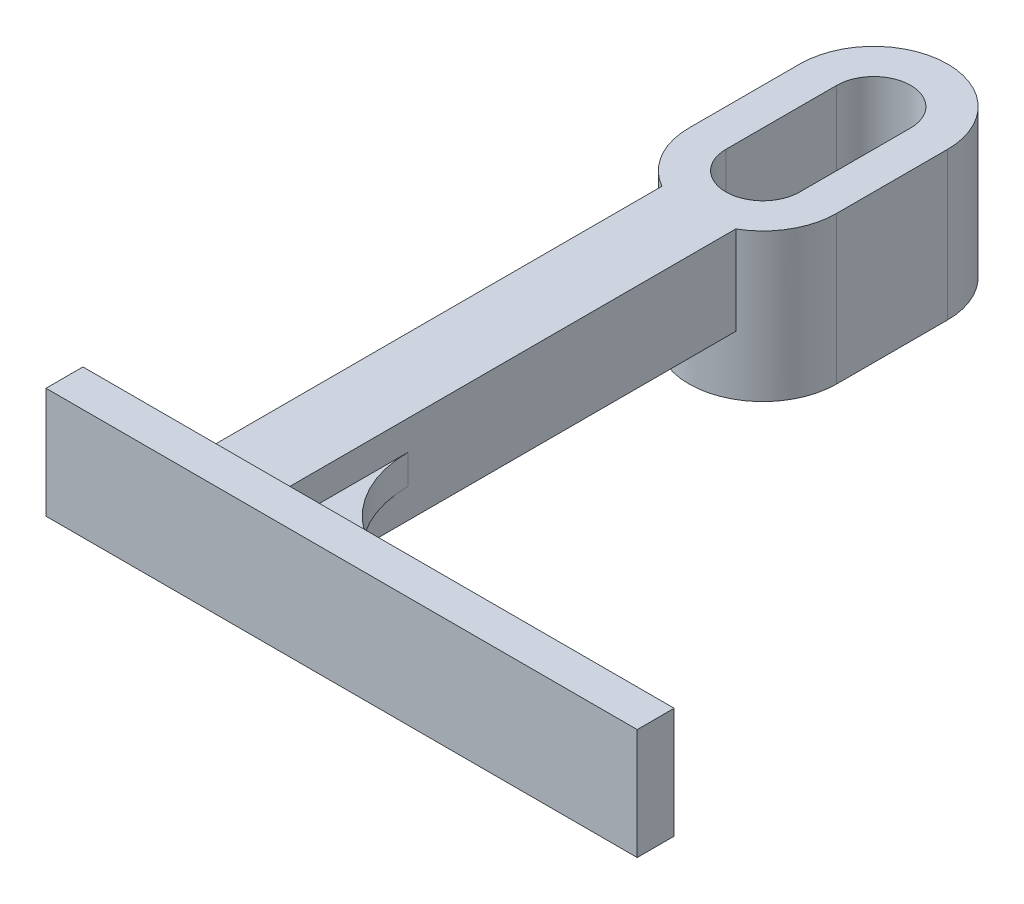
ISO-10303-21;
HEADER;
FILE_DESCRIPTION(('STEP AP214'),'2;1');
FILE_NAME('part.step','',(''),(''),'','','');
FILE_SCHEMA(('AUTOMOTIVE_DESIGN { 1 0 10303 214 1 1 1 1 }'));
ENDSEC;
DATA;
#1=APPLICATION_CONTEXT('core data for automotive mechanical design processes');
#2=APPLICATION_PROTOCOL_DEFINITION('international standard','automotive_design',2000,#1);
#3=PRODUCT_CONTEXT('',#1,'mechanical');
#4=PRODUCT('Part','Part','',(#3));
#5=PRODUCT_RELATED_PRODUCT_CATEGORY('part','',(#4));
#6=PRODUCT_DEFINITION_FORMATION('','',#4);
#7=PRODUCT_DEFINITION_CONTEXT('part definition',#1,'design');
#8=PRODUCT_DEFINITION('design','',#6,#7);
#9=PRODUCT_DEFINITION_SHAPE('','',#8);
#10=(LENGTH_UNIT() NAMED_UNIT(*) SI_UNIT(.MILLI.,.METRE.));
#11=(NAMED_UNIT(*) PLANE_ANGLE_UNIT() SI_UNIT($,.RADIAN.));
#12=(NAMED_UNIT(*) SI_UNIT($,.STERADIAN.) SOLID_ANGLE_UNIT());
#13=UNCERTAINTY_MEASURE_WITH_UNIT(LENGTH_MEASURE(1.E-05),#10,'distance_accuracy_value','');
#14=(GEOMETRIC_REPRESENTATION_CONTEXT(3) GLOBAL_UNCERTAINTY_ASSIGNED_CONTEXT((#13)) GLOBAL_UNIT_ASSIGNED_CONTEXT((#10,
#11,#12)) REPRESENTATION_CONTEXT('',''));
#15=CARTESIAN_POINT('',(0.,0.,0.));
#16=DIRECTION('',(0.,0.,1.));
#17=DIRECTION('',(1.,0.,0.));
#18=AXIS2_PLACEMENT_3D('',#15,#16,#17);
#19=CARTESIAN_POINT('',(-20.,12.,87.));
#20=DIRECTION('',(0.,0.,-1.));
#21=DIRECTION('',(-1.,0.,0.));
#22=AXIS2_PLACEMENT_3D('',#19,#20,#21);
#23=PLANE('',#22);
#24=DIRECTION('',(0.,-1.,0.));
#25=VECTOR('',#24,1.);
#26=CARTESIAN_POINT('',(-20.,12.,87.));
#27=LINE('',#26,#25);
#28=CARTESIAN_POINT('',(-20.,4.,87.));
#29=VERTEX_POINT('',#28);
#30=CARTESIAN_POINT('',(-20.,0.,87.));
#31=VERTEX_POINT('',#30);
#32=EDGE_CURVE('E299',#29,#31,#27,.T.);
#33=ORIENTED_EDGE('',*,*,#32,.F.);
#34=DIRECTION('',(1.,0.,0.));
#35=VECTOR('',#34,1.);
#36=CARTESIAN_POINT('',(-4.99999999999999,4.,87.));
#37=LINE('',#36,#35);
#38=CARTESIAN_POINT('',(-4.99999999999999,4.,87.));
#39=VERTEX_POINT('',#38);
#40=EDGE_CURVE('E433',#29,#39,#37,.T.);
#41=ORIENTED_EDGE('',*,*,#40,.T.);
#42=DIRECTION('',(0.,-1.,0.));
#43=VECTOR('',#42,1.);
#44=CARTESIAN_POINT('',(-4.99999999999999,12.,87.));
#45=LINE('',#44,#43);
#46=CARTESIAN_POINT('',(-4.99999999999999,0.,87.));
#47=VERTEX_POINT('',#46);
#48=EDGE_CURVE('E253',#39,#47,#45,.T.);
#49=ORIENTED_EDGE('',*,*,#48,.T.);
#50=DIRECTION('',(1.,0.,0.));
#51=VECTOR('',#50,1.);
#52=CARTESIAN_POINT('',(-20.,0.,87.));
#53=LINE('',#52,#51);
#54=EDGE_CURVE('E291',#31,#47,#53,.T.);
#55=ORIENTED_EDGE('',*,*,#54,.F.);
#56=EDGE_LOOP('',(#33,#41,#49,#55));
#57=FACE_BOUND('',#56,.T.);
#58=ADVANCED_FACE('F71',(#57),#23,.T.);
#59=CARTESIAN_POINT('',(0.,0.,0.));
#60=DIRECTION('',(0.,1.,0.));
#61=DIRECTION('',(0.,0.,1.));
#62=AXIS2_PLACEMENT_3D('',#59,#60,#61);
#63=PLANE('',#62);
#64=CARTESIAN_POINT('',(0.,0.,15.));
#65=DIRECTION('',(0.,-1.,0.));
#66=DIRECTION('',(0.,0.,-1.));
#67=AXIS2_PLACEMENT_3D('',#64,#65,#66);
#68=CIRCLE('',#67,9.99999999999999);
#69=CARTESIAN_POINT('',(5.,0.,23.6602540378444));
#70=VERTEX_POINT('',#69);
#71=CARTESIAN_POINT('',(-5.,0.,23.6602540378444));
#72=VERTEX_POINT('',#71);
#73=EDGE_CURVE('E80',#70,#72,#68,.T.);
#74=ORIENTED_EDGE('',*,*,#73,.F.);
#75=DIRECTION('',(0.,0.,1.));
#76=VECTOR('',#75,1.);
#77=CARTESIAN_POINT('',(5.,0.,0.));
#78=LINE('',#77,#76);
#79=CARTESIAN_POINT('',(5.00000000000001,0.,87.));
#80=VERTEX_POINT('',#79);
#81=EDGE_CURVE('E302',#70,#80,#78,.T.);
#82=ORIENTED_EDGE('',*,*,#81,.T.);
#83=CARTESIAN_POINT('',(60.,0.,87.));
#84=VERTEX_POINT('',#83);
#85=EDGE_CURVE('E289',#80,#84,#53,.T.);
#86=ORIENTED_EDGE('',*,*,#85,.T.);
#87=DIRECTION('',(0.,0.,-1.));
#88=VECTOR('',#87,1.);
#89=CARTESIAN_POINT('',(60.,0.,92.));
#90=LINE('',#89,#88);
#91=CARTESIAN_POINT('',(60.,0.,92.));
#92=VERTEX_POINT('',#91);
#93=EDGE_CURVE('E294',#92,#84,#90,.T.);
#94=ORIENTED_EDGE('',*,*,#93,.F.);
#95=DIRECTION('',(1.,0.,0.));
#96=VECTOR('',#95,1.);
#97=CARTESIAN_POINT('',(-20.,0.,92.));
#98=LINE('',#97,#96);
#99=CARTESIAN_POINT('',(-20.,0.,92.));
#100=VERTEX_POINT('',#99);
#101=EDGE_CURVE('E297',#100,#92,#98,.T.);
#102=ORIENTED_EDGE('',*,*,#101,.F.);
#103=DIRECTION('',(0.,0.,-1.));
#104=VECTOR('',#103,1.);
#105=CARTESIAN_POINT('',(-20.,0.,92.));
#106=LINE('',#105,#104);
#107=EDGE_CURVE('E286',#100,#31,#106,.T.);
#108=ORIENTED_EDGE('',*,*,#107,.T.);
#109=ORIENTED_EDGE('',*,*,#54,.T.);
#110=DIRECTION('',(0.,0.,1.));
#111=VECTOR('',#110,1.);
#112=CARTESIAN_POINT('',(-5.,0.,0.));
#113=LINE('',#112,#111);
#114=EDGE_CURVE('E260',#72,#47,#113,.T.);
#115=ORIENTED_EDGE('',*,*,#114,.F.);
#116=EDGE_LOOP('',(#74,#82,#86,#94,#102,#108,#109,#115));
#117=FACE_BOUND('',#116,.T.);
#118=ADVANCED_FACE('F324',(#117),#63,.F.);
#119=CARTESIAN_POINT('',(5.,12.,0.));
#120=DIRECTION('',(1.,0.,0.));
#121=DIRECTION('',(0.,0.,-1.));
#122=AXIS2_PLACEMENT_3D('',#119,#120,#121);
#123=PLANE('',#122);
#124=DIRECTION('',(0.,0.,1.));
#125=VECTOR('',#124,1.);
#126=CARTESIAN_POINT('',(5.00000000000001,8.,87.));
#127=LINE('',#126,#125);
#128=CARTESIAN_POINT('',(4.99999999999999,8.,68.));
#129=VERTEX_POINT('',#128);
#130=CARTESIAN_POINT('',(5.00000000000001,8.,87.));
#131=VERTEX_POINT('',#130);
#132=EDGE_CURVE('E227',#129,#131,#127,.T.);
#133=ORIENTED_EDGE('',*,*,#132,.F.);
#134=DIRECTION('',(0.,-1.,0.));
#135=VECTOR('',#134,1.);
#136=CARTESIAN_POINT('',(4.99999999999999,8.,68.));
#137=LINE('',#136,#135);
#138=CARTESIAN_POINT('',(4.99999999999999,4.,68.));
#139=VERTEX_POINT('',#138);
#140=EDGE_CURVE('E417',#129,#139,#137,.T.);
#141=ORIENTED_EDGE('',*,*,#140,.T.);
#142=DIRECTION('',(0.,0.,1.));
#143=VECTOR('',#142,1.);
#144=CARTESIAN_POINT('',(5.00000000000001,4.,87.));
#145=LINE('',#144,#143);
#146=CARTESIAN_POINT('',(5.00000000000001,4.,87.));
#147=VERTEX_POINT('',#146);
#148=EDGE_CURVE('E409',#139,#147,#145,.T.);
#149=ORIENTED_EDGE('',*,*,#148,.T.);
#150=DIRECTION('',(0.,-1.,0.));
#151=VECTOR('',#150,1.);
#152=CARTESIAN_POINT('',(5.00000000000001,12.,87.));
#153=LINE('',#152,#151);
#154=EDGE_CURVE('E254',#147,#80,#153,.T.);
#155=ORIENTED_EDGE('',*,*,#154,.T.);
#156=ORIENTED_EDGE('',*,*,#81,.F.);
#157=DIRECTION('',(0.,-1.,0.));
#158=VECTOR('',#157,1.);
#159=CARTESIAN_POINT('',(5.,12.,23.6602540378444));
#160=LINE('',#159,#158);
#161=CARTESIAN_POINT('',(5.,12.,23.6602540378444));
#162=VERTEX_POINT('',#161);
#163=EDGE_CURVE('E275',#162,#70,#160,.T.);
#164=ORIENTED_EDGE('',*,*,#163,.F.);
#165=DIRECTION('',(0.,0.,1.));
#166=VECTOR('',#165,1.);
#167=CARTESIAN_POINT('',(5.,12.,0.));
#168=LINE('',#167,#166);
#169=CARTESIAN_POINT('',(5.,12.,87.));
#170=VERTEX_POINT('',#169);
#171=EDGE_CURVE('E252',#162,#170,#168,.T.);
#172=ORIENTED_EDGE('',*,*,#171,.T.);
#173=EDGE_CURVE('E244',#170,#131,#153,.T.);
#174=ORIENTED_EDGE('',*,*,#173,.T.);
#175=EDGE_LOOP('',(#133,#141,#149,#155,#156,#164,#172,#174));
#176=FACE_BOUND('',#175,.T.);
#177=ADVANCED_FACE('F250',(#176),#123,.T.);
#178=CARTESIAN_POINT('',(10.,12.,0.));
#179=DIRECTION('',(1.,0.,0.));
#180=DIRECTION('',(0.,0.,-1.));
#181=AXIS2_PLACEMENT_3D('',#178,#179,#180);
#182=PLANE('',#181);
#183=DIRECTION('',(0.,-1.,0.));
#184=VECTOR('',#183,1.);
#185=CARTESIAN_POINT('',(10.,12.,15.));
#186=LINE('',#185,#184);
#187=CARTESIAN_POINT('',(10.,12.,15.));
#188=VERTEX_POINT('',#187);
#189=CARTESIAN_POINT('',(9.99999999999999,-8.,15.));
#190=VERTEX_POINT('',#189);
#191=EDGE_CURVE('E273',#188,#190,#186,.T.);
#192=ORIENTED_EDGE('',*,*,#191,.T.);
#193=DIRECTION('',(0.,0.,1.));
#194=VECTOR('',#193,1.);
#195=CARTESIAN_POINT('',(9.99999999999999,-8.,15.));
#196=LINE('',#195,#194);
#197=CARTESIAN_POINT('',(10.,-8.,0.));
#198=VERTEX_POINT('',#197);
#199=EDGE_CURVE('E290',#198,#190,#196,.T.);
#200=ORIENTED_EDGE('',*,*,#199,.F.);
#201=DIRECTION('',(0.,-1.,0.));
#202=VECTOR('',#201,1.);
#203=CARTESIAN_POINT('',(10.,12.,0.));
#204=LINE('',#203,#202);
#205=CARTESIAN_POINT('',(10.,12.,0.));
#206=VERTEX_POINT('',#205);
#207=EDGE_CURVE('E271',#206,#198,#204,.T.);
#208=ORIENTED_EDGE('',*,*,#207,.F.);
#209=DIRECTION('',(0.,0.,1.));
#210=VECTOR('',#209,1.);
#211=CARTESIAN_POINT('',(10.,12.,0.));
#212=LINE('',#211,#210);
#213=EDGE_CURVE('E383',#206,#188,#212,.T.);
#214=ORIENTED_EDGE('',*,*,#213,.T.);
#215=EDGE_LOOP('',(#192,#200,#208,#214));
#216=FACE_BOUND('',#215,.T.);
#217=ADVANCED_FACE('F504',(#216),#182,.T.);
#218=CARTESIAN_POINT('',(0.,12.,0.));
#219=DIRECTION('',(0.,-1.,0.));
#220=DIRECTION('',(0.,0.,-1.));
#221=AXIS2_PLACEMENT_3D('',#218,#219,#220);
#222=CYLINDRICAL_SURFACE('',#221,10.);
#223=ORIENTED_EDGE('',*,*,#207,.T.);
#224=CARTESIAN_POINT('',(0.,-8.,0.));
#225=DIRECTION('',(0.,-1.,0.));
#226=DIRECTION('',(0.,0.,-1.));
#227=AXIS2_PLACEMENT_3D('',#224,#225,#226);
#228=CIRCLE('',#227,9.99999999999999);
#229=CARTESIAN_POINT('',(-9.99999999999999,-8.,0.));
#230=VERTEX_POINT('',#229);
#231=EDGE_CURVE('E363',#230,#198,#228,.T.);
#232=ORIENTED_EDGE('',*,*,#231,.F.);
#233=DIRECTION('',(0.,-1.,0.));
#234=VECTOR('',#233,1.);
#235=CARTESIAN_POINT('',(-10.,12.,0.));
#236=LINE('',#235,#234);
#237=CARTESIAN_POINT('',(-10.,12.,0.));
#238=VERTEX_POINT('',#237);
#239=EDGE_CURVE('E269',#238,#230,#236,.T.);
#240=ORIENTED_EDGE('',*,*,#239,.F.);
#241=CARTESIAN_POINT('',(0.,12.,0.));
#242=DIRECTION('',(0.,1.,0.));
#243=DIRECTION('',(0.,0.,1.));
#244=AXIS2_PLACEMENT_3D('',#241,#242,#243);
#245=CIRCLE('',#244,10.);
#246=EDGE_CURVE('E386',#206,#238,#245,.T.);
#247=ORIENTED_EDGE('',*,*,#246,.F.);
#248=EDGE_LOOP('',(#223,#232,#240,#247));
#249=FACE_BOUND('',#248,.T.);
#250=ADVANCED_FACE('F507',(#249),#222,.T.);
#251=CARTESIAN_POINT('',(-10.,12.,0.));
#252=DIRECTION('',(1.,0.,0.));
#253=DIRECTION('',(0.,0.,-1.));
#254=AXIS2_PLACEMENT_3D('',#251,#252,#253);
#255=PLANE('',#254);
#256=ORIENTED_EDGE('',*,*,#239,.T.);
#257=DIRECTION('',(0.,0.,-1.));
#258=VECTOR('',#257,1.);
#259=CARTESIAN_POINT('',(-9.99999999999999,-8.,15.));
#260=LINE('',#259,#258);
#261=CARTESIAN_POINT('',(-9.99999999999999,-8.,15.));
#262=VERTEX_POINT('',#261);
#263=EDGE_CURVE('E360',#262,#230,#260,.T.);
#264=ORIENTED_EDGE('',*,*,#263,.F.);
#265=DIRECTION('',(0.,-1.,0.));
#266=VECTOR('',#265,1.);
#267=CARTESIAN_POINT('',(-10.,12.,15.));
#268=LINE('',#267,#266);
#269=CARTESIAN_POINT('',(-10.,12.,15.));
#270=VERTEX_POINT('',#269);
#271=EDGE_CURVE('E267',#270,#262,#268,.T.);
#272=ORIENTED_EDGE('',*,*,#271,.F.);
#273=DIRECTION('',(0.,0.,1.));
#274=VECTOR('',#273,1.);
#275=CARTESIAN_POINT('',(-10.,12.,0.));
#276=LINE('',#275,#274);
#277=EDGE_CURVE('E389',#238,#270,#276,.T.);
#278=ORIENTED_EDGE('',*,*,#277,.F.);
#279=EDGE_LOOP('',(#256,#264,#272,#278));
#280=FACE_BOUND('',#279,.T.);
#281=ADVANCED_FACE('F511',(#280),#255,.F.);
#282=CARTESIAN_POINT('',(0.,12.,15.));
#283=DIRECTION('',(0.,-1.,0.));
#284=DIRECTION('',(0.,0.,-1.));
#285=AXIS2_PLACEMENT_3D('',#282,#283,#284);
#286=CYLINDRICAL_SURFACE('',#285,10.);
#287=ORIENTED_EDGE('',*,*,#271,.T.);
#288=CARTESIAN_POINT('',(0.,-8.,15.));
#289=DIRECTION('',(0.,-1.,0.));
#290=DIRECTION('',(0.,0.,-1.));
#291=AXIS2_PLACEMENT_3D('',#288,#289,#290);
#292=CIRCLE('',#291,9.99999999999999);
#293=EDGE_CURVE('E357',#190,#262,#292,.T.);
#294=ORIENTED_EDGE('',*,*,#293,.F.);
#295=ORIENTED_EDGE('',*,*,#191,.F.);
#296=CARTESIAN_POINT('',(0.,12.,15.));
#297=DIRECTION('',(0.,1.,0.));
#298=DIRECTION('',(0.,0.,1.));
#299=AXIS2_PLACEMENT_3D('',#296,#297,#298);
#300=CIRCLE('',#299,10.);
#301=EDGE_CURVE('E381',#162,#188,#300,.T.);
#302=ORIENTED_EDGE('',*,*,#301,.F.);
#303=ORIENTED_EDGE('',*,*,#163,.T.);
#304=ORIENTED_EDGE('',*,*,#73,.T.);
#305=DIRECTION('',(0.,-1.,0.));
#306=VECTOR('',#305,1.);
#307=CARTESIAN_POINT('',(-5.,12.,23.6602540378444));
#308=LINE('',#307,#306);
#309=CARTESIAN_POINT('',(-5.,12.,23.6602540378444));
#310=VERTEX_POINT('',#309);
#311=EDGE_CURVE('E264',#310,#72,#308,.T.);
#312=ORIENTED_EDGE('',*,*,#311,.F.);
#313=CARTESIAN_POINT('',(0.,12.,15.));
#314=DIRECTION('',(0.,1.,0.));
#315=DIRECTION('',(0.,0.,1.));
#316=AXIS2_PLACEMENT_3D('',#313,#314,#315);
#317=CIRCLE('',#316,10.);
#318=EDGE_CURVE('E392',#270,#310,#317,.T.);
#319=ORIENTED_EDGE('',*,*,#318,.F.);
#320=EDGE_LOOP('',(#287,#294,#295,#302,#303,#304,#312,#319));
#321=FACE_BOUND('',#320,.T.);
#322=ADVANCED_FACE('F404',(#321),#286,.T.);
#323=CARTESIAN_POINT('',(-5.,12.,0.));
#324=DIRECTION('',(1.,0.,0.));
#325=DIRECTION('',(0.,0.,-1.));
#326=AXIS2_PLACEMENT_3D('',#323,#324,#325);
#327=PLANE('',#326);
#328=DIRECTION('',(0.,-1.,0.));
#329=VECTOR('',#328,1.);
#330=CARTESIAN_POINT('',(-5.,8.,72.));
#331=LINE('',#330,#329);
#332=CARTESIAN_POINT('',(-5.,8.,72.));
#333=VERTEX_POINT('',#332);
#334=CARTESIAN_POINT('',(-5.,4.,72.));
#335=VERTEX_POINT('',#334);
#336=EDGE_CURVE('E430',#333,#335,#331,.T.);
#337=ORIENTED_EDGE('',*,*,#336,.F.);
#338=DIRECTION('',(0.,0.,-1.));
#339=VECTOR('',#338,1.);
#340=CARTESIAN_POINT('',(-5.,8.,72.));
#341=LINE('',#340,#339);
#342=CARTESIAN_POINT('',(-4.99999999999999,8.,87.));
#343=VERTEX_POINT('',#342);
#344=EDGE_CURVE('E428',#343,#333,#341,.T.);
#345=ORIENTED_EDGE('',*,*,#344,.F.);
#346=CARTESIAN_POINT('',(-4.99999999999999,12.,87.));
#347=VERTEX_POINT('',#346);
#348=EDGE_CURVE('E256',#347,#343,#45,.T.);
#349=ORIENTED_EDGE('',*,*,#348,.F.);
#350=DIRECTION('',(0.,0.,1.));
#351=VECTOR('',#350,1.);
#352=CARTESIAN_POINT('',(-5.,12.,0.));
#353=LINE('',#352,#351);
#354=EDGE_CURVE('E281',#310,#347,#353,.T.);
#355=ORIENTED_EDGE('',*,*,#354,.F.);
#356=ORIENTED_EDGE('',*,*,#311,.T.);
#357=ORIENTED_EDGE('',*,*,#114,.T.);
#358=ORIENTED_EDGE('',*,*,#48,.F.);
#359=DIRECTION('',(0.,0.,-1.));
#360=VECTOR('',#359,1.);
#361=CARTESIAN_POINT('',(-5.,4.,72.));
#362=LINE('',#361,#360);
#363=EDGE_CURVE('E96',#39,#335,#362,.T.);
#364=ORIENTED_EDGE('',*,*,#363,.T.);
#365=EDGE_LOOP('',(#337,#345,#349,#355,#356,#357,#358,#364));
#366=FACE_BOUND('',#365,.T.);
#367=ADVANCED_FACE('F400',(#366),#327,.F.);
#368=CARTESIAN_POINT('',(0.,12.,15.));
#369=DIRECTION('',(0.,-1.,0.));
#370=DIRECTION('',(0.,0.,-1.));
#371=AXIS2_PLACEMENT_3D('',#368,#369,#370);
#372=CYLINDRICAL_SURFACE('',#371,5.);
#373=DIRECTION('',(0.,-1.,0.));
#374=VECTOR('',#373,1.);
#375=CARTESIAN_POINT('',(5.,12.,15.));
#376=LINE('',#375,#374);
#377=CARTESIAN_POINT('',(5.,12.,15.));
#378=VERTEX_POINT('',#377);
#379=CARTESIAN_POINT('',(5.,-8.,15.));
#380=VERTEX_POINT('',#379);
#381=EDGE_CURVE('E278',#378,#380,#376,.T.);
#382=ORIENTED_EDGE('',*,*,#381,.T.);
#383=CARTESIAN_POINT('',(0.,-8.,15.));
#384=DIRECTION('',(0.,-1.,0.));
#385=DIRECTION('',(0.,0.,-1.));
#386=AXIS2_PLACEMENT_3D('',#383,#384,#385);
#387=CIRCLE('',#386,5.);
#388=CARTESIAN_POINT('',(-5.,-8.,15.));
#389=VERTEX_POINT('',#388);
#390=EDGE_CURVE('E351',#380,#389,#387,.T.);
#391=ORIENTED_EDGE('',*,*,#390,.T.);
#392=DIRECTION('',(0.,-1.,0.));
#393=VECTOR('',#392,1.);
#394=CARTESIAN_POINT('',(-5.,12.,15.));
#395=LINE('',#394,#393);
#396=CARTESIAN_POINT('',(-5.,12.,15.));
#397=VERTEX_POINT('',#396);
#398=EDGE_CURVE('E258',#397,#389,#395,.T.);
#399=ORIENTED_EDGE('',*,*,#398,.F.);
#400=CARTESIAN_POINT('',(0.,12.,15.));
#401=DIRECTION('',(0.,1.,0.));
#402=DIRECTION('',(0.,0.,1.));
#403=AXIS2_PLACEMENT_3D('',#400,#401,#402);
#404=CIRCLE('',#403,5.);
#405=EDGE_CURVE('E369',#397,#378,#404,.T.);
#406=ORIENTED_EDGE('',*,*,#405,.T.);
#407=EDGE_LOOP('',(#382,#391,#399,#406));
#408=FACE_BOUND('',#407,.T.);
#409=ADVANCED_FACE('F487',(#408),#372,.F.);
#410=CARTESIAN_POINT('',(-5.,12.,0.));
#411=DIRECTION('',(1.,0.,0.));
#412=DIRECTION('',(0.,0.,-1.));
#413=AXIS2_PLACEMENT_3D('',#410,#411,#412);
#414=PLANE('',#413);
#415=ORIENTED_EDGE('',*,*,#398,.T.);
#416=DIRECTION('',(0.,0.,-1.));
#417=VECTOR('',#416,1.);
#418=CARTESIAN_POINT('',(-5.,-8.,0.));
#419=LINE('',#418,#417);
#420=CARTESIAN_POINT('',(-5.,-8.,0.));
#421=VERTEX_POINT('',#420);
#422=EDGE_CURVE('E354',#389,#421,#419,.T.);
#423=ORIENTED_EDGE('',*,*,#422,.T.);
#424=DIRECTION('',(0.,-1.,0.));
#425=VECTOR('',#424,1.);
#426=CARTESIAN_POINT('',(-5.,12.,0.));
#427=LINE('',#426,#425);
#428=CARTESIAN_POINT('',(-5.,12.,0.));
#429=VERTEX_POINT('',#428);
#430=EDGE_CURVE('E283',#429,#421,#427,.T.);
#431=ORIENTED_EDGE('',*,*,#430,.F.);
#432=DIRECTION('',(0.,0.,1.));
#433=VECTOR('',#432,1.);
#434=CARTESIAN_POINT('',(-5.,12.,0.));
#435=LINE('',#434,#433);
#436=EDGE_CURVE('E372',#429,#397,#435,.T.);
#437=ORIENTED_EDGE('',*,*,#436,.T.);
#438=EDGE_LOOP('',(#415,#423,#431,#437));
#439=FACE_BOUND('',#438,.T.);
#440=ADVANCED_FACE('F490',(#439),#414,.T.);
#441=CARTESIAN_POINT('',(0.,12.,0.));
#442=DIRECTION('',(0.,-1.,0.));
#443=DIRECTION('',(0.,0.,-1.));
#444=AXIS2_PLACEMENT_3D('',#441,#442,#443);
#445=CYLINDRICAL_SURFACE('',#444,5.);
#446=ORIENTED_EDGE('',*,*,#430,.T.);
#447=CARTESIAN_POINT('',(0.,-8.,0.));
#448=DIRECTION('',(0.,-1.,0.));
#449=DIRECTION('',(0.,0.,-1.));
#450=AXIS2_PLACEMENT_3D('',#447,#448,#449);
#451=CIRCLE('',#450,5.);
#452=CARTESIAN_POINT('',(5.,-8.,0.));
#453=VERTEX_POINT('',#452);
#454=EDGE_CURVE('E340',#421,#453,#451,.T.);
#455=ORIENTED_EDGE('',*,*,#454,.T.);
#456=DIRECTION('',(0.,-1.,0.));
#457=VECTOR('',#456,1.);
#458=CARTESIAN_POINT('',(5.,12.,0.));
#459=LINE('',#458,#457);
#460=CARTESIAN_POINT('',(5.,12.,0.));
#461=VERTEX_POINT('',#460);
#462=EDGE_CURVE('E280',#461,#453,#459,.T.);
#463=ORIENTED_EDGE('',*,*,#462,.F.);
#464=CARTESIAN_POINT('',(0.,12.,0.));
#465=DIRECTION('',(0.,1.,0.));
#466=DIRECTION('',(0.,0.,1.));
#467=AXIS2_PLACEMENT_3D('',#464,#465,#466);
#468=CIRCLE('',#467,5.);
#469=EDGE_CURVE('E375',#461,#429,#468,.T.);
#470=ORIENTED_EDGE('',*,*,#469,.T.);
#471=EDGE_LOOP('',(#446,#455,#463,#470));
#472=FACE_BOUND('',#471,.T.);
#473=ADVANCED_FACE('F494',(#472),#445,.F.);
#474=CARTESIAN_POINT('',(5.,12.,0.));
#475=DIRECTION('',(1.,0.,0.));
#476=DIRECTION('',(0.,0.,-1.));
#477=AXIS2_PLACEMENT_3D('',#474,#475,#476);
#478=PLANE('',#477);
#479=ORIENTED_EDGE('',*,*,#462,.T.);
#480=DIRECTION('',(0.,0.,1.));
#481=VECTOR('',#480,1.);
#482=CARTESIAN_POINT('',(5.,-8.,0.));
#483=LINE('',#482,#481);
#484=EDGE_CURVE('E348',#453,#380,#483,.T.);
#485=ORIENTED_EDGE('',*,*,#484,.T.);
#486=ORIENTED_EDGE('',*,*,#381,.F.);
#487=DIRECTION('',(0.,0.,1.));
#488=VECTOR('',#487,1.);
#489=CARTESIAN_POINT('',(5.,12.,0.));
#490=LINE('',#489,#488);
#491=EDGE_CURVE('E378',#461,#378,#490,.T.);
#492=ORIENTED_EDGE('',*,*,#491,.F.);
#493=EDGE_LOOP('',(#479,#485,#486,#492));
#494=FACE_BOUND('',#493,.T.);
#495=ADVANCED_FACE('F483',(#494),#478,.F.);
#496=CARTESIAN_POINT('',(0.,12.,0.));
#497=DIRECTION('',(0.,1.,0.));
#498=DIRECTION('',(0.,0.,1.));
#499=AXIS2_PLACEMENT_3D('',#496,#497,#498);
#500=PLANE('',#499);
#501=DIRECTION('',(-1.,0.,0.));
#502=VECTOR('',#501,1.);
#503=CARTESIAN_POINT('',(-20.,12.,87.));
#504=LINE('',#503,#502);
#505=EDGE_CURVE('E12',#170,#347,#504,.T.);
#506=ORIENTED_EDGE('',*,*,#505,.F.);
#507=ORIENTED_EDGE('',*,*,#171,.F.);
#508=ORIENTED_EDGE('',*,*,#301,.T.);
#509=ORIENTED_EDGE('',*,*,#213,.F.);
#510=ORIENTED_EDGE('',*,*,#246,.T.);
#511=ORIENTED_EDGE('',*,*,#277,.T.);
#512=ORIENTED_EDGE('',*,*,#318,.T.);
#513=ORIENTED_EDGE('',*,*,#354,.T.);
#514=EDGE_LOOP('',(#506,#507,#508,#509,#510,#511,#512,#513));
#515=FACE_BOUND('',#514,.T.);
#516=ORIENTED_EDGE('',*,*,#405,.F.);
#517=ORIENTED_EDGE('',*,*,#436,.F.);
#518=ORIENTED_EDGE('',*,*,#469,.F.);
#519=ORIENTED_EDGE('',*,*,#491,.T.);
#520=EDGE_LOOP('',(#516,#517,#518,#519));
#521=FACE_BOUND('',#520,.T.);
#522=ADVANCED_FACE('F474',(#515,#521),#500,.T.);
#523=CARTESIAN_POINT('',(-20.,12.,92.));
#524=DIRECTION('',(0.,0.,-1.));
#525=DIRECTION('',(-1.,0.,0.));
#526=AXIS2_PLACEMENT_3D('',#523,#524,#525);
#527=PLANE('',#526);
#528=ORIENTED_EDGE('',*,*,#101,.T.);
#529=DIRECTION('',(0.,-1.,0.));
#530=VECTOR('',#529,1.);
#531=CARTESIAN_POINT('',(60.,12.,92.));
#532=LINE('',#531,#530);
#533=CARTESIAN_POINT('',(60.,15.,92.));
#534=VERTEX_POINT('',#533);
#535=EDGE_CURVE('E303',#534,#92,#532,.T.);
#536=ORIENTED_EDGE('',*,*,#535,.F.);
#537=DIRECTION('',(1.,0.,0.));
#538=VECTOR('',#537,1.);
#539=CARTESIAN_POINT('',(-20.,15.,92.));
#540=LINE('',#539,#538);
#541=CARTESIAN_POINT('',(-20.,15.,92.));
#542=VERTEX_POINT('',#541);
#543=EDGE_CURVE('E338',#542,#534,#540,.T.);
#544=ORIENTED_EDGE('',*,*,#543,.F.);
#545=DIRECTION('',(0.,-1.,0.));
#546=VECTOR('',#545,1.);
#547=CARTESIAN_POINT('',(-20.,12.,92.));
#548=LINE('',#547,#546);
#549=EDGE_CURVE('E300',#542,#100,#548,.T.);
#550=ORIENTED_EDGE('',*,*,#549,.T.);
#551=EDGE_LOOP('',(#528,#536,#544,#550));
#552=FACE_BOUND('',#551,.T.);
#553=ADVANCED_FACE('F327',(#552),#527,.F.);
#554=CARTESIAN_POINT('',(60.,12.,92.));
#555=DIRECTION('',(-1.,0.,0.));
#556=DIRECTION('',(0.,0.,1.));
#557=AXIS2_PLACEMENT_3D('',#554,#555,#556);
#558=PLANE('',#557);
#559=ORIENTED_EDGE('',*,*,#93,.T.);
#560=DIRECTION('',(0.,-1.,0.));
#561=VECTOR('',#560,1.);
#562=CARTESIAN_POINT('',(60.,12.,87.));
#563=LINE('',#562,#561);
#564=CARTESIAN_POINT('',(60.,15.,87.));
#565=VERTEX_POINT('',#564);
#566=EDGE_CURVE('E305',#565,#84,#563,.T.);
#567=ORIENTED_EDGE('',*,*,#566,.F.);
#568=DIRECTION('',(0.,0.,-1.));
#569=VECTOR('',#568,1.);
#570=CARTESIAN_POINT('',(60.,15.,87.));
#571=LINE('',#570,#569);
#572=EDGE_CURVE('E334',#534,#565,#571,.T.);
#573=ORIENTED_EDGE('',*,*,#572,.F.);
#574=ORIENTED_EDGE('',*,*,#535,.T.);
#575=EDGE_LOOP('',(#559,#567,#573,#574));
#576=FACE_BOUND('',#575,.T.);
#577=ADVANCED_FACE('F332',(#576),#558,.F.);
#578=CARTESIAN_POINT('',(-20.,12.,92.));
#579=DIRECTION('',(-1.,0.,0.));
#580=DIRECTION('',(0.,0.,1.));
#581=AXIS2_PLACEMENT_3D('',#578,#579,#580);
#582=PLANE('',#581);
#583=ORIENTED_EDGE('',*,*,#107,.F.);
#584=ORIENTED_EDGE('',*,*,#549,.F.);
#585=DIRECTION('',(0.,0.,1.));
#586=VECTOR('',#585,1.);
#587=CARTESIAN_POINT('',(-20.,15.,87.));
#588=LINE('',#587,#586);
#589=CARTESIAN_POINT('',(-20.,15.,87.));
#590=VERTEX_POINT('',#589);
#591=EDGE_CURVE('E342',#590,#542,#588,.T.);
#592=ORIENTED_EDGE('',*,*,#591,.F.);
#593=CARTESIAN_POINT('',(-20.,8.,87.));
#594=VERTEX_POINT('',#593);
#595=EDGE_CURVE('E75',#590,#594,#27,.T.);
#596=ORIENTED_EDGE('',*,*,#595,.T.);
#597=DIRECTION('',(0.,-1.,0.));
#598=VECTOR('',#597,1.);
#599=CARTESIAN_POINT('',(-20.,8.,87.));
#600=LINE('',#599,#598);
#601=EDGE_CURVE('E317',#594,#29,#600,.T.);
#602=ORIENTED_EDGE('',*,*,#601,.T.);
#603=ORIENTED_EDGE('',*,*,#32,.T.);
#604=EDGE_LOOP('',(#583,#584,#592,#596,#602,#603));
#605=FACE_BOUND('',#604,.T.);
#606=ADVANCED_FACE('F73',(#605),#582,.T.);
#607=DIRECTION('',(1.,0.,0.));
#608=VECTOR('',#607,1.);
#609=CARTESIAN_POINT('',(32.5,8.,87.));
#610=LINE('',#609,#608);
#611=CARTESIAN_POINT('',(32.5,8.,87.));
#612=VERTEX_POINT('',#611);
#613=EDGE_CURVE('E230',#131,#612,#610,.T.);
#614=ORIENTED_EDGE('',*,*,#613,.F.);
#615=ORIENTED_EDGE('',*,*,#173,.F.);
#616=ORIENTED_EDGE('',*,*,#505,.T.);
#617=ORIENTED_EDGE('',*,*,#348,.T.);
#618=DIRECTION('',(1.,0.,0.));
#619=VECTOR('',#618,1.);
#620=CARTESIAN_POINT('',(-4.99999999999999,8.,87.));
#621=LINE('',#620,#619);
#622=EDGE_CURVE('E426',#594,#343,#621,.T.);
#623=ORIENTED_EDGE('',*,*,#622,.F.);
#624=ORIENTED_EDGE('',*,*,#595,.F.);
#625=DIRECTION('',(-1.,0.,0.));
#626=VECTOR('',#625,1.);
#627=CARTESIAN_POINT('',(-20.,15.,87.));
#628=LINE('',#627,#626);
#629=EDGE_CURVE('E337',#565,#590,#628,.T.);
#630=ORIENTED_EDGE('',*,*,#629,.F.);
#631=ORIENTED_EDGE('',*,*,#566,.T.);
#632=ORIENTED_EDGE('',*,*,#85,.F.);
#633=ORIENTED_EDGE('',*,*,#154,.F.);
#634=DIRECTION('',(1.,0.,0.));
#635=VECTOR('',#634,1.);
#636=CARTESIAN_POINT('',(32.5,4.,87.));
#637=LINE('',#636,#635);
#638=CARTESIAN_POINT('',(32.5,4.,87.));
#639=VERTEX_POINT('',#638);
#640=EDGE_CURVE('E410',#147,#639,#637,.T.);
#641=ORIENTED_EDGE('',*,*,#640,.T.);
#642=DIRECTION('',(0.,-1.,0.));
#643=VECTOR('',#642,1.);
#644=CARTESIAN_POINT('',(32.5,8.,87.));
#645=LINE('',#644,#643);
#646=EDGE_CURVE('E247',#612,#639,#645,.T.);
#647=ORIENTED_EDGE('',*,*,#646,.F.);
#648=EDGE_LOOP('',(#614,#615,#616,#617,#623,#624,#630,#631,#632,#633,#641,#647));
#649=FACE_BOUND('',#648,.T.);
#650=ADVANCED_FACE('F243',(#649),#23,.T.);
#651=CARTESIAN_POINT('',(0.,-8.,15.));
#652=DIRECTION('',(0.,-1.,0.));
#653=DIRECTION('',(0.,0.,-1.));
#654=AXIS2_PLACEMENT_3D('',#651,#652,#653);
#655=PLANE('',#654);
#656=ORIENTED_EDGE('',*,*,#293,.T.);
#657=ORIENTED_EDGE('',*,*,#263,.T.);
#658=ORIENTED_EDGE('',*,*,#231,.T.);
#659=ORIENTED_EDGE('',*,*,#199,.T.);
#660=EDGE_LOOP('',(#656,#657,#658,#659));
#661=FACE_BOUND('',#660,.T.);
#662=ORIENTED_EDGE('',*,*,#484,.F.);
#663=ORIENTED_EDGE('',*,*,#454,.F.);
#664=ORIENTED_EDGE('',*,*,#422,.F.);
#665=ORIENTED_EDGE('',*,*,#390,.F.);
#666=EDGE_LOOP('',(#662,#663,#664,#665));
#667=FACE_BOUND('',#666,.T.);
#668=ADVANCED_FACE('F467',(#661,#667),#655,.T.);
#669=CARTESIAN_POINT('',(0.,15.,0.));
#670=DIRECTION('',(0.,1.,0.));
#671=DIRECTION('',(0.,0.,1.));
#672=AXIS2_PLACEMENT_3D('',#669,#670,#671);
#673=PLANE('',#672);
#674=ORIENTED_EDGE('',*,*,#591,.T.);
#675=ORIENTED_EDGE('',*,*,#543,.T.);
#676=ORIENTED_EDGE('',*,*,#572,.T.);
#677=ORIENTED_EDGE('',*,*,#629,.T.);
#678=EDGE_LOOP('',(#674,#675,#676,#677));
#679=FACE_BOUND('',#678,.T.);
#680=ADVANCED_FACE('F438',(#679),#673,.T.);
#681=CARTESIAN_POINT('',(-20.,8.,72.));
#682=DIRECTION('',(0.,-1.,0.));
#683=DIRECTION('',(0.,0.,-1.));
#684=AXIS2_PLACEMENT_3D('',#681,#682,#683);
#685=CYLINDRICAL_SURFACE('',#684,15.);
#686=CARTESIAN_POINT('',(-20.,4.,72.));
#687=DIRECTION('',(0.,-1.,0.));
#688=DIRECTION('',(0.,0.,1.));
#689=AXIS2_PLACEMENT_3D('',#686,#687,#688);
#690=CIRCLE('',#689,15.);
#691=EDGE_CURVE('E423',#335,#29,#690,.T.);
#692=ORIENTED_EDGE('',*,*,#691,.T.);
#693=ORIENTED_EDGE('',*,*,#601,.F.);
#694=CARTESIAN_POINT('',(-20.,8.,72.));
#695=DIRECTION('',(0.,-1.,0.));
#696=DIRECTION('',(0.,0.,1.));
#697=AXIS2_PLACEMENT_3D('',#694,#695,#696);
#698=CIRCLE('',#697,15.);
#699=EDGE_CURVE('E424',#333,#594,#698,.T.);
#700=ORIENTED_EDGE('',*,*,#699,.F.);
#701=ORIENTED_EDGE('',*,*,#336,.T.);
#702=EDGE_LOOP('',(#692,#693,#700,#701));
#703=FACE_BOUND('',#702,.T.);
#704=ADVANCED_FACE('F446',(#703),#685,.F.);
#705=CARTESIAN_POINT('',(-20.,8.,72.));
#706=DIRECTION('',(0.,1.,0.));
#707=DIRECTION('',(0.,0.,1.));
#708=AXIS2_PLACEMENT_3D('',#705,#706,#707);
#709=PLANE('',#708);
#710=ORIENTED_EDGE('',*,*,#699,.T.);
#711=ORIENTED_EDGE('',*,*,#622,.T.);
#712=ORIENTED_EDGE('',*,*,#344,.T.);
#713=EDGE_LOOP('',(#710,#711,#712));
#714=FACE_BOUND('',#713,.T.);
#715=ADVANCED_FACE('F443',(#714),#709,.T.);
#716=CARTESIAN_POINT('',(-20.,4.,72.));
#717=DIRECTION('',(0.,1.,0.));
#718=DIRECTION('',(0.,0.,1.));
#719=AXIS2_PLACEMENT_3D('',#716,#717,#718);
#720=PLANE('',#719);
#721=ORIENTED_EDGE('',*,*,#691,.F.);
#722=ORIENTED_EDGE('',*,*,#363,.F.);
#723=ORIENTED_EDGE('',*,*,#40,.F.);
#724=EDGE_LOOP('',(#721,#722,#723));
#725=FACE_BOUND('',#724,.T.);
#726=ADVANCED_FACE('F447',(#725),#720,.F.);
#727=CARTESIAN_POINT('',(16.0180444964245,8.,82.4618128312997));
#728=DIRECTION('',(-0.265463700238368,0.,0.96412085541998));
#729=DIRECTION('',(0.96412085541998,0.,0.265463700238368));
#730=AXIS2_PLACEMENT_3D('',#727,#728,#729);
#731=PLANE('',#730);
#732=DIRECTION('',(-0.96412085541998,0.,-0.265463700238368));
#733=VECTOR('',#732,1.);
#734=CARTESIAN_POINT('',(16.0180444964245,4.,82.4618128312997));
#735=LINE('',#734,#733);
#736=CARTESIAN_POINT('',(16.0180444964245,4.,82.4618128312997));
#737=VERTEX_POINT('',#736);
#738=EDGE_CURVE('E88',#639,#737,#735,.T.);
#739=ORIENTED_EDGE('',*,*,#738,.T.);
#740=DIRECTION('',(0.,-1.,0.));
#741=VECTOR('',#740,1.);
#742=CARTESIAN_POINT('',(16.0180444964245,8.,82.4618128312997));
#743=LINE('',#742,#741);
#744=CARTESIAN_POINT('',(16.0180444964245,8.,82.4618128312997));
#745=VERTEX_POINT('',#744);
#746=EDGE_CURVE('E419',#745,#737,#743,.T.);
#747=ORIENTED_EDGE('',*,*,#746,.F.);
#748=DIRECTION('',(-0.96412085541998,0.,-0.265463700238368));
#749=VECTOR('',#748,1.);
#750=CARTESIAN_POINT('',(16.0180444964245,8.,82.4618128312997));
#751=LINE('',#750,#749);
#752=EDGE_CURVE('E248',#612,#745,#751,.T.);
#753=ORIENTED_EDGE('',*,*,#752,.F.);
#754=ORIENTED_EDGE('',*,*,#646,.T.);
#755=EDGE_LOOP('',(#739,#747,#753,#754));
#756=FACE_BOUND('',#755,.T.);
#757=ADVANCED_FACE('F449',(#756),#731,.F.);
#758=CARTESIAN_POINT('',(20.,8.,68.));
#759=DIRECTION('',(0.,-1.,0.));
#760=DIRECTION('',(0.,0.,-1.));
#761=AXIS2_PLACEMENT_3D('',#758,#759,#760);
#762=CYLINDRICAL_SURFACE('',#761,15.);
#763=CARTESIAN_POINT('',(20.,4.,68.));
#764=DIRECTION('',(0.,-1.,0.));
#765=DIRECTION('',(0.,0.,1.));
#766=AXIS2_PLACEMENT_3D('',#763,#764,#765);
#767=CIRCLE('',#766,15.);
#768=EDGE_CURVE('E238',#737,#139,#767,.T.);
#769=ORIENTED_EDGE('',*,*,#768,.T.);
#770=ORIENTED_EDGE('',*,*,#140,.F.);
#771=CARTESIAN_POINT('',(20.,8.,68.));
#772=DIRECTION('',(0.,-1.,0.));
#773=DIRECTION('',(0.,0.,1.));
#774=AXIS2_PLACEMENT_3D('',#771,#772,#773);
#775=CIRCLE('',#774,15.);
#776=EDGE_CURVE('E233',#745,#129,#775,.T.);
#777=ORIENTED_EDGE('',*,*,#776,.F.);
#778=ORIENTED_EDGE('',*,*,#746,.T.);
#779=EDGE_LOOP('',(#769,#770,#777,#778));
#780=FACE_BOUND('',#779,.T.);
#781=ADVANCED_FACE('F455',(#780),#762,.F.);
#782=CARTESIAN_POINT('',(20.,8.,68.));
#783=DIRECTION('',(0.,1.,0.));
#784=DIRECTION('',(0.,0.,1.));
#785=AXIS2_PLACEMENT_3D('',#782,#783,#784);
#786=PLANE('',#785);
#787=ORIENTED_EDGE('',*,*,#132,.T.);
#788=ORIENTED_EDGE('',*,*,#613,.T.);
#789=ORIENTED_EDGE('',*,*,#752,.T.);
#790=ORIENTED_EDGE('',*,*,#776,.T.);
#791=EDGE_LOOP('',(#787,#788,#789,#790));
#792=FACE_BOUND('',#791,.T.);
#793=ADVANCED_FACE('F229',(#792),#786,.T.);
#794=CARTESIAN_POINT('',(20.,4.,68.));
#795=DIRECTION('',(0.,1.,0.));
#796=DIRECTION('',(0.,0.,1.));
#797=AXIS2_PLACEMENT_3D('',#794,#795,#796);
#798=PLANE('',#797);
#799=ORIENTED_EDGE('',*,*,#148,.F.);
#800=ORIENTED_EDGE('',*,*,#768,.F.);
#801=ORIENTED_EDGE('',*,*,#738,.F.);
#802=ORIENTED_EDGE('',*,*,#640,.F.);
#803=EDGE_LOOP('',(#799,#800,#801,#802));
#804=FACE_BOUND('',#803,.T.);
#805=ADVANCED_FACE('F558',(#804),#798,.F.);
#806=CLOSED_SHELL('',(#58,#118,#177,#217,#250,#281,#322,#367,#409,#440,#473,#495,#522,#553,#577,
#606,#650,#668,#680,#704,#715,#726,#757,#781,#793,#805));
#807=MANIFOLD_SOLID_BREP('B2',#806);
#808=ADVANCED_BREP_SHAPE_REPRESENTATION('',(#18,#807),#14);
#809=SHAPE_DEFINITION_REPRESENTATION(#9,#808);
ENDSEC;
END-ISO-10303-21;
